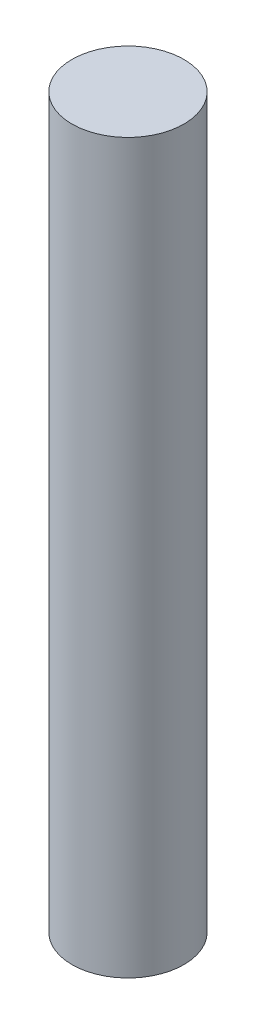
ISO-10303-21;
HEADER;
FILE_DESCRIPTION(('STEP AP214'),'2;1');
FILE_NAME('part.step','',(''),(''),'','','');
FILE_SCHEMA(('AUTOMOTIVE_DESIGN { 1 0 10303 214 1 1 1 1 }'));
ENDSEC;
DATA;
#1=APPLICATION_CONTEXT('core data for automotive mechanical design processes');
#2=APPLICATION_PROTOCOL_DEFINITION('international standard','automotive_design',2000,#1);
#3=PRODUCT_CONTEXT('',#1,'mechanical');
#4=PRODUCT('Part','Part','',(#3));
#5=PRODUCT_RELATED_PRODUCT_CATEGORY('part','',(#4));
#6=PRODUCT_DEFINITION_FORMATION('','',#4);
#7=PRODUCT_DEFINITION_CONTEXT('part definition',#1,'design');
#8=PRODUCT_DEFINITION('design','',#6,#7);
#9=PRODUCT_DEFINITION_SHAPE('','',#8);
#10=(LENGTH_UNIT() NAMED_UNIT(*) SI_UNIT(.MILLI.,.METRE.));
#11=(NAMED_UNIT(*) PLANE_ANGLE_UNIT() SI_UNIT($,.RADIAN.));
#12=(NAMED_UNIT(*) SI_UNIT($,.STERADIAN.) SOLID_ANGLE_UNIT());
#13=UNCERTAINTY_MEASURE_WITH_UNIT(LENGTH_MEASURE(1.E-05),#10,'distance_accuracy_value','');
#14=(GEOMETRIC_REPRESENTATION_CONTEXT(3) GLOBAL_UNCERTAINTY_ASSIGNED_CONTEXT((#13)) GLOBAL_UNIT_ASSIGNED_CONTEXT((#10,
#11,#12)) REPRESENTATION_CONTEXT('',''));
#15=CARTESIAN_POINT('',(0.,0.,0.));
#16=DIRECTION('',(0.,0.,1.));
#17=DIRECTION('',(1.,0.,0.));
#18=AXIS2_PLACEMENT_3D('',#15,#16,#17);
#19=CARTESIAN_POINT('',(0.,1981.2,0.));
#20=DIRECTION('',(0.,-1.,0.));
#21=DIRECTION('',(0.,0.,-1.));
#22=AXIS2_PLACEMENT_3D('',#19,#20,#21);
#23=CYLINDRICAL_SURFACE('',#22,152.4);
#24=CARTESIAN_POINT('',(0.,1981.2,0.));
#25=DIRECTION('',(0.,1.,0.));
#26=DIRECTION('',(0.,0.,1.));
#27=AXIS2_PLACEMENT_3D('',#24,#25,#26);
#28=CIRCLE('',#27,152.4);
#29=CARTESIAN_POINT('',(0.,1981.2,152.4));
#30=VERTEX_POINT('',#29);
#31=EDGE_CURVE('E10',#30,#30,#28,.T.);
#32=ORIENTED_EDGE('',*,*,#31,.F.);
#33=EDGE_LOOP('',(#32));
#34=FACE_BOUND('',#33,.T.);
#35=CARTESIAN_POINT('',(0.,0.,0.));
#36=DIRECTION('',(0.,1.,0.));
#37=DIRECTION('',(0.,0.,1.));
#38=AXIS2_PLACEMENT_3D('',#35,#36,#37);
#39=CIRCLE('',#38,152.4);
#40=CARTESIAN_POINT('',(0.,0.,152.4));
#41=VERTEX_POINT('',#40);
#42=EDGE_CURVE('E33',#41,#41,#39,.T.);
#43=ORIENTED_EDGE('',*,*,#42,.T.);
#44=EDGE_LOOP('',(#43));
#45=FACE_BOUND('',#44,.T.);
#46=ADVANCED_FACE('F30',(#34,#45),#23,.T.);
#47=CARTESIAN_POINT('',(0.,1981.2,0.));
#48=DIRECTION('',(0.,1.,0.));
#49=DIRECTION('',(0.,0.,1.));
#50=AXIS2_PLACEMENT_3D('',#47,#48,#49);
#51=PLANE('',#50);
#52=ORIENTED_EDGE('',*,*,#31,.T.);
#53=EDGE_LOOP('',(#52));
#54=FACE_BOUND('',#53,.T.);
#55=ADVANCED_FACE('F45',(#54),#51,.T.);
#56=CARTESIAN_POINT('',(0.,0.,0.));
#57=DIRECTION('',(0.,1.,0.));
#58=DIRECTION('',(0.,0.,1.));
#59=AXIS2_PLACEMENT_3D('',#56,#57,#58);
#60=PLANE('',#59);
#61=ORIENTED_EDGE('',*,*,#42,.F.);
#62=EDGE_LOOP('',(#61));
#63=FACE_BOUND('',#62,.T.);
#64=ADVANCED_FACE('F43',(#63),#60,.F.);
#65=CLOSED_SHELL('',(#46,#55,#64));
#66=MANIFOLD_SOLID_BREP('B2',#65);
#67=ADVANCED_BREP_SHAPE_REPRESENTATION('',(#18,#66),#14);
#68=SHAPE_DEFINITION_REPRESENTATION(#9,#67);
ENDSEC;
END-ISO-10303-21;
